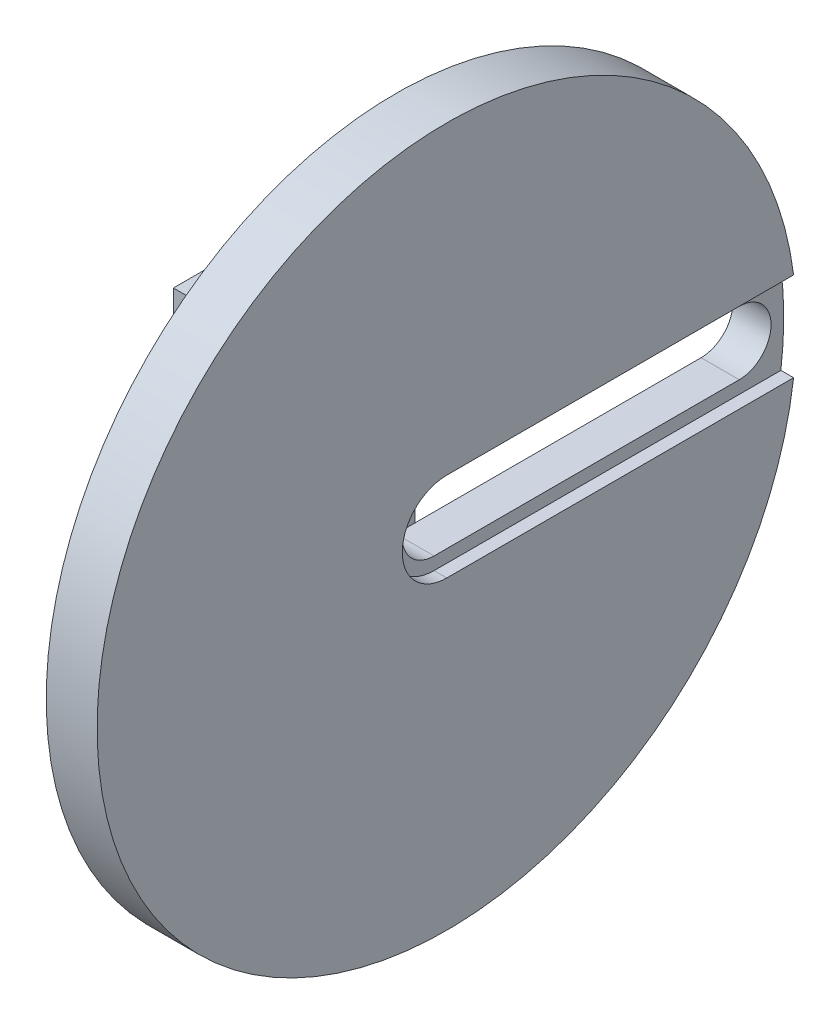
ISO-10303-21;
HEADER;
FILE_DESCRIPTION(('STEP AP214'),'2;1');
FILE_NAME('part.step','',(''),(''),'','','');
FILE_SCHEMA(('AUTOMOTIVE_DESIGN { 1 0 10303 214 1 1 1 1 }'));
ENDSEC;
DATA;
#1=APPLICATION_CONTEXT('core data for automotive mechanical design processes');
#2=APPLICATION_PROTOCOL_DEFINITION('international standard','automotive_design',2000,#1);
#3=PRODUCT_CONTEXT('',#1,'mechanical');
#4=PRODUCT('Part','Part','',(#3));
#5=PRODUCT_RELATED_PRODUCT_CATEGORY('part','',(#4));
#6=PRODUCT_DEFINITION_FORMATION('','',#4);
#7=PRODUCT_DEFINITION_CONTEXT('part definition',#1,'design');
#8=PRODUCT_DEFINITION('design','',#6,#7);
#9=PRODUCT_DEFINITION_SHAPE('','',#8);
#10=(LENGTH_UNIT() NAMED_UNIT(*) SI_UNIT(.MILLI.,.METRE.));
#11=(NAMED_UNIT(*) PLANE_ANGLE_UNIT() SI_UNIT($,.RADIAN.));
#12=(NAMED_UNIT(*) SI_UNIT($,.STERADIAN.) SOLID_ANGLE_UNIT());
#13=UNCERTAINTY_MEASURE_WITH_UNIT(LENGTH_MEASURE(1.E-05),#10,'distance_accuracy_value','');
#14=(GEOMETRIC_REPRESENTATION_CONTEXT(3) GLOBAL_UNCERTAINTY_ASSIGNED_CONTEXT((#13)) GLOBAL_UNIT_ASSIGNED_CONTEXT((#10,
#11,#12)) REPRESENTATION_CONTEXT('',''));
#15=CARTESIAN_POINT('',(0.,0.,0.));
#16=DIRECTION('',(0.,0.,1.));
#17=DIRECTION('',(1.,0.,0.));
#18=AXIS2_PLACEMENT_3D('',#15,#16,#17);
#19=CARTESIAN_POINT('',(-0.001000000000001,0.,0.));
#20=DIRECTION('',(1.,0.,0.));
#21=DIRECTION('',(0.,0.,-1.));
#22=AXIS2_PLACEMENT_3D('',#19,#20,#21);
#23=CYLINDRICAL_SURFACE('',#22,5.);
#24=CARTESIAN_POINT('',(36.,0.,0.));
#25=DIRECTION('',(1.,0.,0.));
#26=DIRECTION('',(0.,0.,-1.));
#27=AXIS2_PLACEMENT_3D('',#24,#25,#26);
#28=CIRCLE('',#27,5.);
#29=CARTESIAN_POINT('',(36.,-5.,0.));
#30=VERTEX_POINT('',#29);
#31=CARTESIAN_POINT('',(36.,5.,0.));
#32=VERTEX_POINT('',#31);
#33=EDGE_CURVE('E186',#30,#32,#28,.F.);
#34=ORIENTED_EDGE('',*,*,#33,.F.);
#35=DIRECTION('',(1.,0.,0.));
#36=VECTOR('',#35,1.);
#37=CARTESIAN_POINT('',(-0.001000000000001,-5.,0.));
#38=LINE('',#37,#36);
#39=CARTESIAN_POINT('',(30.,-5.,0.));
#40=VERTEX_POINT('',#39);
#41=EDGE_CURVE('E196',#40,#30,#38,.T.);
#42=ORIENTED_EDGE('',*,*,#41,.F.);
#43=CARTESIAN_POINT('',(30.,0.,0.));
#44=DIRECTION('',(1.,0.,0.));
#45=DIRECTION('',(0.,0.,-1.));
#46=AXIS2_PLACEMENT_3D('',#43,#44,#45);
#47=CIRCLE('',#46,5.);
#48=CARTESIAN_POINT('',(30.,5.,0.));
#49=VERTEX_POINT('',#48);
#50=EDGE_CURVE('E193',#40,#49,#47,.F.);
#51=ORIENTED_EDGE('',*,*,#50,.T.);
#52=DIRECTION('',(1.,0.,0.));
#53=VECTOR('',#52,1.);
#54=CARTESIAN_POINT('',(-0.001000000000001,5.,0.));
#55=LINE('',#54,#53);
#56=EDGE_CURVE('E197',#49,#32,#55,.T.);
#57=ORIENTED_EDGE('',*,*,#56,.T.);
#58=EDGE_LOOP('',(#34,#42,#51,#57));
#59=FACE_BOUND('',#58,.T.);
#60=ADVANCED_FACE('F32',(#59),#23,.F.);
#61=CARTESIAN_POINT('',(-0.001000000000001,5.,0.));
#62=DIRECTION('',(0.,-1.,0.));
#63=DIRECTION('',(0.,0.,-1.));
#64=AXIS2_PLACEMENT_3D('',#61,#62,#63);
#65=PLANE('',#64);
#66=DIRECTION('',(1.,0.,0.));
#67=VECTOR('',#66,1.);
#68=CARTESIAN_POINT('',(-0.001000000000001,5.,-48.));
#69=LINE('',#68,#67);
#70=CARTESIAN_POINT('',(30.,5.,-48.));
#71=VERTEX_POINT('',#70);
#72=CARTESIAN_POINT('',(36.,5.,-48.));
#73=VERTEX_POINT('',#72);
#74=EDGE_CURVE('E201',#71,#73,#69,.T.);
#75=ORIENTED_EDGE('',*,*,#74,.T.);
#76=DIRECTION('',(0.,0.,1.));
#77=VECTOR('',#76,1.);
#78=CARTESIAN_POINT('',(36.,5.,0.));
#79=LINE('',#78,#77);
#80=EDGE_CURVE('E183',#73,#32,#79,.T.);
#81=ORIENTED_EDGE('',*,*,#80,.T.);
#82=ORIENTED_EDGE('',*,*,#56,.F.);
#83=DIRECTION('',(0.,0.,1.));
#84=VECTOR('',#83,1.);
#85=CARTESIAN_POINT('',(30.,5.,0.));
#86=LINE('',#85,#84);
#87=EDGE_CURVE('E190',#71,#49,#86,.T.);
#88=ORIENTED_EDGE('',*,*,#87,.F.);
#89=EDGE_LOOP('',(#75,#81,#82,#88));
#90=FACE_BOUND('',#89,.T.);
#91=ADVANCED_FACE('F337',(#90),#65,.T.);
#92=CARTESIAN_POINT('',(-0.001000000000001,0.,-48.));
#93=DIRECTION('',(1.,0.,0.));
#94=DIRECTION('',(0.,0.,-1.));
#95=AXIS2_PLACEMENT_3D('',#92,#93,#94);
#96=CYLINDRICAL_SURFACE('',#95,5.);
#97=CARTESIAN_POINT('',(36.,0.,-48.));
#98=DIRECTION('',(1.,0.,0.));
#99=DIRECTION('',(0.,0.,-1.));
#100=AXIS2_PLACEMENT_3D('',#97,#98,#99);
#101=CIRCLE('',#100,5.);
#102=CARTESIAN_POINT('',(36.,-5.,-48.));
#103=VERTEX_POINT('',#102);
#104=EDGE_CURVE('E54',#73,#103,#101,.F.);
#105=ORIENTED_EDGE('',*,*,#104,.F.);
#106=ORIENTED_EDGE('',*,*,#74,.F.);
#107=CARTESIAN_POINT('',(30.,0.,-48.));
#108=DIRECTION('',(1.,0.,0.));
#109=DIRECTION('',(0.,0.,-1.));
#110=AXIS2_PLACEMENT_3D('',#107,#108,#109);
#111=CIRCLE('',#110,5.);
#112=CARTESIAN_POINT('',(30.,-5.,-48.));
#113=VERTEX_POINT('',#112);
#114=EDGE_CURVE('E188',#71,#113,#111,.F.);
#115=ORIENTED_EDGE('',*,*,#114,.T.);
#116=DIRECTION('',(1.,0.,0.));
#117=VECTOR('',#116,1.);
#118=CARTESIAN_POINT('',(-0.001000000000001,-5.,-48.));
#119=LINE('',#118,#117);
#120=EDGE_CURVE('E204',#113,#103,#119,.T.);
#121=ORIENTED_EDGE('',*,*,#120,.T.);
#122=EDGE_LOOP('',(#105,#106,#115,#121));
#123=FACE_BOUND('',#122,.T.);
#124=ADVANCED_FACE('F343',(#123),#96,.F.);
#125=CARTESIAN_POINT('',(-0.001000000000001,-5.,0.));
#126=DIRECTION('',(0.,-1.,0.));
#127=DIRECTION('',(0.,0.,-1.));
#128=AXIS2_PLACEMENT_3D('',#125,#126,#127);
#129=PLANE('',#128);
#130=DIRECTION('',(0.,0.,1.));
#131=VECTOR('',#130,1.);
#132=CARTESIAN_POINT('',(36.,-5.,0.));
#133=LINE('',#132,#131);
#134=EDGE_CURVE('E11',#103,#30,#133,.T.);
#135=ORIENTED_EDGE('',*,*,#134,.F.);
#136=ORIENTED_EDGE('',*,*,#120,.F.);
#137=DIRECTION('',(0.,0.,1.));
#138=VECTOR('',#137,1.);
#139=CARTESIAN_POINT('',(30.,-5.,0.));
#140=LINE('',#139,#138);
#141=EDGE_CURVE('E200',#113,#40,#140,.T.);
#142=ORIENTED_EDGE('',*,*,#141,.T.);
#143=ORIENTED_EDGE('',*,*,#41,.T.);
#144=EDGE_LOOP('',(#135,#136,#142,#143));
#145=FACE_BOUND('',#144,.T.);
#146=ADVANCED_FACE('F348',(#145),#129,.F.);
#147=CARTESIAN_POINT('',(18.,0.,0.));
#148=DIRECTION('',(-1.,0.,0.));
#149=DIRECTION('',(0.,0.,1.));
#150=AXIS2_PLACEMENT_3D('',#147,#148,#149);
#151=PLANE('',#150);
#152=CARTESIAN_POINT('',(18.,0.,0.));
#153=DIRECTION('',(-1.,0.,0.));
#154=DIRECTION('',(0.,0.,1.));
#155=AXIS2_PLACEMENT_3D('',#152,#153,#154);
#156=CIRCLE('',#155,9.);
#157=CARTESIAN_POINT('',(18.,0.,9.));
#158=VERTEX_POINT('',#157);
#159=EDGE_CURVE('E175',#158,#158,#156,.F.);
#160=ORIENTED_EDGE('',*,*,#159,.F.);
#161=EDGE_LOOP('',(#160));
#162=FACE_BOUND('',#161,.T.);
#163=DIRECTION('',(0.,0.,1.));
#164=VECTOR('',#163,1.);
#165=CARTESIAN_POINT('',(18.,-18.,15.));
#166=LINE('',#165,#164);
#167=CARTESIAN_POINT('',(18.,-18.,-15.));
#168=VERTEX_POINT('',#167);
#169=CARTESIAN_POINT('',(18.,-18.,15.));
#170=VERTEX_POINT('',#169);
#171=EDGE_CURVE('E215',#168,#170,#166,.T.);
#172=ORIENTED_EDGE('',*,*,#171,.F.);
#173=DIRECTION('',(0.,1.,0.));
#174=VECTOR('',#173,1.);
#175=CARTESIAN_POINT('',(18.,-26.,-15.));
#176=LINE('',#175,#174);
#177=CARTESIAN_POINT('',(18.,18.,-15.));
#178=VERTEX_POINT('',#177);
#179=EDGE_CURVE('E271',#168,#178,#176,.T.);
#180=ORIENTED_EDGE('',*,*,#179,.T.);
#181=DIRECTION('',(0.,0.,-1.));
#182=VECTOR('',#181,1.);
#183=CARTESIAN_POINT('',(18.,18.,15.));
#184=LINE('',#183,#182);
#185=CARTESIAN_POINT('',(18.,18.,15.));
#186=VERTEX_POINT('',#185);
#187=EDGE_CURVE('E238',#186,#178,#184,.T.);
#188=ORIENTED_EDGE('',*,*,#187,.F.);
#189=DIRECTION('',(0.,-1.,0.));
#190=VECTOR('',#189,1.);
#191=CARTESIAN_POINT('',(18.,-26.,15.));
#192=LINE('',#191,#190);
#193=EDGE_CURVE('E260',#186,#170,#192,.T.);
#194=ORIENTED_EDGE('',*,*,#193,.T.);
#195=EDGE_LOOP('',(#172,#180,#188,#194));
#196=FACE_BOUND('',#195,.T.);
#197=ADVANCED_FACE('F317',(#162,#196),#151,.F.);
#198=CARTESIAN_POINT('',(10.,0.,0.));
#199=DIRECTION('',(-1.,0.,0.));
#200=DIRECTION('',(0.,0.,1.));
#201=AXIS2_PLACEMENT_3D('',#198,#199,#200);
#202=PLANE('',#201);
#203=CARTESIAN_POINT('',(10.,0.,0.));
#204=DIRECTION('',(-1.,0.,0.));
#205=DIRECTION('',(0.,0.,1.));
#206=AXIS2_PLACEMENT_3D('',#203,#204,#205);
#207=CIRCLE('',#206,9.);
#208=CARTESIAN_POINT('',(10.,0.,9.));
#209=VERTEX_POINT('',#208);
#210=EDGE_CURVE('E169',#209,#209,#207,.F.);
#211=ORIENTED_EDGE('',*,*,#210,.T.);
#212=EDGE_LOOP('',(#211));
#213=FACE_BOUND('',#212,.T.);
#214=DIRECTION('',(0.,1.,0.));
#215=VECTOR('',#214,1.);
#216=CARTESIAN_POINT('',(10.,-26.,-15.));
#217=LINE('',#216,#215);
#218=CARTESIAN_POINT('',(10.,-26.,-15.));
#219=VERTEX_POINT('',#218);
#220=CARTESIAN_POINT('',(10.,26.,-15.));
#221=VERTEX_POINT('',#220);
#222=EDGE_CURVE('E269',#219,#221,#217,.T.);
#223=ORIENTED_EDGE('',*,*,#222,.F.);
#224=DIRECTION('',(0.,0.,-1.));
#225=VECTOR('',#224,1.);
#226=CARTESIAN_POINT('',(10.,-26.,15.));
#227=LINE('',#226,#225);
#228=CARTESIAN_POINT('',(10.,-26.,15.));
#229=VERTEX_POINT('',#228);
#230=EDGE_CURVE('E272',#229,#219,#227,.T.);
#231=ORIENTED_EDGE('',*,*,#230,.F.);
#232=DIRECTION('',(0.,-1.,0.));
#233=VECTOR('',#232,1.);
#234=CARTESIAN_POINT('',(10.,-26.,15.));
#235=LINE('',#234,#233);
#236=CARTESIAN_POINT('',(10.,26.,15.));
#237=VERTEX_POINT('',#236);
#238=EDGE_CURVE('E276',#237,#229,#235,.T.);
#239=ORIENTED_EDGE('',*,*,#238,.F.);
#240=DIRECTION('',(0.,0.,1.));
#241=VECTOR('',#240,1.);
#242=CARTESIAN_POINT('',(10.,26.,15.));
#243=LINE('',#242,#241);
#244=EDGE_CURVE('E282',#221,#237,#243,.T.);
#245=ORIENTED_EDGE('',*,*,#244,.F.);
#246=EDGE_LOOP('',(#223,#231,#239,#245));
#247=FACE_BOUND('',#246,.T.);
#248=ADVANCED_FACE('F302',(#213,#247),#202,.T.);
#249=CARTESIAN_POINT('',(18.,-26.,-15.));
#250=DIRECTION('',(0.,0.,1.));
#251=DIRECTION('',(1.,0.,0.));
#252=AXIS2_PLACEMENT_3D('',#249,#250,#251);
#253=PLANE('',#252);
#254=ORIENTED_EDGE('',*,*,#222,.T.);
#255=DIRECTION('',(-1.,0.,0.));
#256=VECTOR('',#255,1.);
#257=CARTESIAN_POINT('',(18.,26.,-15.));
#258=LINE('',#257,#256);
#259=CARTESIAN_POINT('',(30.,26.,-15.));
#260=VERTEX_POINT('',#259);
#261=EDGE_CURVE('E40',#260,#221,#258,.T.);
#262=ORIENTED_EDGE('',*,*,#261,.F.);
#263=DIRECTION('',(0.,1.,0.));
#264=VECTOR('',#263,1.);
#265=CARTESIAN_POINT('',(30.,26.,-15.));
#266=LINE('',#265,#264);
#267=CARTESIAN_POINT('',(30.,18.,-15.));
#268=VERTEX_POINT('',#267);
#269=EDGE_CURVE('E245',#268,#260,#266,.T.);
#270=ORIENTED_EDGE('',*,*,#269,.F.);
#271=DIRECTION('',(-1.,0.,0.));
#272=VECTOR('',#271,1.);
#273=CARTESIAN_POINT('',(30.,18.,-15.));
#274=LINE('',#273,#272);
#275=EDGE_CURVE('E251',#268,#178,#274,.T.);
#276=ORIENTED_EDGE('',*,*,#275,.T.);
#277=ORIENTED_EDGE('',*,*,#179,.F.);
#278=DIRECTION('',(-1.,0.,0.));
#279=VECTOR('',#278,1.);
#280=CARTESIAN_POINT('',(30.,-18.,-15.));
#281=LINE('',#280,#279);
#282=CARTESIAN_POINT('',(30.,-18.,-15.));
#283=VERTEX_POINT('',#282);
#284=EDGE_CURVE('E235',#283,#168,#281,.T.);
#285=ORIENTED_EDGE('',*,*,#284,.F.);
#286=DIRECTION('',(0.,1.,0.));
#287=VECTOR('',#286,1.);
#288=CARTESIAN_POINT('',(30.,-26.,-15.));
#289=LINE('',#288,#287);
#290=CARTESIAN_POINT('',(30.,-26.,-15.));
#291=VERTEX_POINT('',#290);
#292=EDGE_CURVE('E224',#291,#283,#289,.T.);
#293=ORIENTED_EDGE('',*,*,#292,.F.);
#294=DIRECTION('',(-1.,0.,0.));
#295=VECTOR('',#294,1.);
#296=CARTESIAN_POINT('',(18.,-26.,-15.));
#297=LINE('',#296,#295);
#298=EDGE_CURVE('E275',#291,#219,#297,.T.);
#299=ORIENTED_EDGE('',*,*,#298,.T.);
#300=EDGE_LOOP('',(#254,#262,#270,#276,#277,#285,#293,#299));
#301=FACE_BOUND('',#300,.T.);
#302=ADVANCED_FACE('F34',(#301),#253,.F.);
#303=CARTESIAN_POINT('',(18.,26.,15.));
#304=DIRECTION('',(0.,-1.,0.));
#305=DIRECTION('',(0.,0.,-1.));
#306=AXIS2_PLACEMENT_3D('',#303,#304,#305);
#307=PLANE('',#306);
#308=ORIENTED_EDGE('',*,*,#244,.T.);
#309=DIRECTION('',(-1.,0.,0.));
#310=VECTOR('',#309,1.);
#311=CARTESIAN_POINT('',(18.,26.,15.));
#312=LINE('',#311,#310);
#313=CARTESIAN_POINT('',(30.,26.,15.));
#314=VERTEX_POINT('',#313);
#315=EDGE_CURVE('E289',#314,#237,#312,.T.);
#316=ORIENTED_EDGE('',*,*,#315,.F.);
#317=DIRECTION('',(0.,0.,1.));
#318=VECTOR('',#317,1.);
#319=CARTESIAN_POINT('',(30.,26.,15.));
#320=LINE('',#319,#318);
#321=EDGE_CURVE('E248',#260,#314,#320,.T.);
#322=ORIENTED_EDGE('',*,*,#321,.F.);
#323=ORIENTED_EDGE('',*,*,#261,.T.);
#324=EDGE_LOOP('',(#308,#316,#322,#323));
#325=FACE_BOUND('',#324,.T.);
#326=ADVANCED_FACE('F295',(#325),#307,.F.);
#327=CARTESIAN_POINT('',(18.,-26.,15.));
#328=DIRECTION('',(0.,0.,-1.));
#329=DIRECTION('',(-1.,0.,0.));
#330=AXIS2_PLACEMENT_3D('',#327,#328,#329);
#331=PLANE('',#330);
#332=ORIENTED_EDGE('',*,*,#238,.T.);
#333=DIRECTION('',(-1.,0.,0.));
#334=VECTOR('',#333,1.);
#335=CARTESIAN_POINT('',(18.,-26.,15.));
#336=LINE('',#335,#334);
#337=CARTESIAN_POINT('',(30.,-26.,15.));
#338=VERTEX_POINT('',#337);
#339=EDGE_CURVE('E287',#338,#229,#336,.T.);
#340=ORIENTED_EDGE('',*,*,#339,.F.);
#341=DIRECTION('',(0.,-1.,0.));
#342=VECTOR('',#341,1.);
#343=CARTESIAN_POINT('',(30.,-26.,15.));
#344=LINE('',#343,#342);
#345=CARTESIAN_POINT('',(30.,-18.,15.));
#346=VERTEX_POINT('',#345);
#347=EDGE_CURVE('E218',#346,#338,#344,.T.);
#348=ORIENTED_EDGE('',*,*,#347,.F.);
#349=DIRECTION('',(-1.,0.,0.));
#350=VECTOR('',#349,1.);
#351=CARTESIAN_POINT('',(30.,-18.,15.));
#352=LINE('',#351,#350);
#353=EDGE_CURVE('E230',#346,#170,#352,.T.);
#354=ORIENTED_EDGE('',*,*,#353,.T.);
#355=ORIENTED_EDGE('',*,*,#193,.F.);
#356=DIRECTION('',(-1.,0.,0.));
#357=VECTOR('',#356,1.);
#358=CARTESIAN_POINT('',(30.,18.,15.));
#359=LINE('',#358,#357);
#360=CARTESIAN_POINT('',(30.,18.,15.));
#361=VERTEX_POINT('',#360);
#362=EDGE_CURVE('E264',#361,#186,#359,.T.);
#363=ORIENTED_EDGE('',*,*,#362,.F.);
#364=DIRECTION('',(0.,-1.,0.));
#365=VECTOR('',#364,1.);
#366=CARTESIAN_POINT('',(30.,26.,15.));
#367=LINE('',#366,#365);
#368=EDGE_CURVE('E239',#314,#361,#367,.T.);
#369=ORIENTED_EDGE('',*,*,#368,.F.);
#370=ORIENTED_EDGE('',*,*,#315,.T.);
#371=EDGE_LOOP('',(#332,#340,#348,#354,#355,#363,#369,#370));
#372=FACE_BOUND('',#371,.T.);
#373=ADVANCED_FACE('F305',(#372),#331,.F.);
#374=CARTESIAN_POINT('',(18.,-26.,15.));
#375=DIRECTION('',(0.,1.,0.));
#376=DIRECTION('',(0.,0.,1.));
#377=AXIS2_PLACEMENT_3D('',#374,#375,#376);
#378=PLANE('',#377);
#379=ORIENTED_EDGE('',*,*,#230,.T.);
#380=ORIENTED_EDGE('',*,*,#298,.F.);
#381=DIRECTION('',(0.,0.,-1.));
#382=VECTOR('',#381,1.);
#383=CARTESIAN_POINT('',(30.,-26.,15.));
#384=LINE('',#383,#382);
#385=EDGE_CURVE('E221',#338,#291,#384,.T.);
#386=ORIENTED_EDGE('',*,*,#385,.F.);
#387=ORIENTED_EDGE('',*,*,#339,.T.);
#388=EDGE_LOOP('',(#379,#380,#386,#387));
#389=FACE_BOUND('',#388,.T.);
#390=ADVANCED_FACE('F308',(#389),#378,.F.);
#391=CARTESIAN_POINT('',(30.,18.,15.));
#392=DIRECTION('',(0.,1.,0.));
#393=DIRECTION('',(0.,0.,1.));
#394=AXIS2_PLACEMENT_3D('',#391,#392,#393);
#395=PLANE('',#394);
#396=ORIENTED_EDGE('',*,*,#187,.T.);
#397=ORIENTED_EDGE('',*,*,#275,.F.);
#398=DIRECTION('',(0.,0.,-1.));
#399=VECTOR('',#398,1.);
#400=CARTESIAN_POINT('',(30.,18.,15.));
#401=LINE('',#400,#399);
#402=EDGE_CURVE('E242',#361,#268,#401,.T.);
#403=ORIENTED_EDGE('',*,*,#402,.F.);
#404=ORIENTED_EDGE('',*,*,#362,.T.);
#405=EDGE_LOOP('',(#396,#397,#403,#404));
#406=FACE_BOUND('',#405,.T.);
#407=ADVANCED_FACE('F320',(#406),#395,.F.);
#408=CARTESIAN_POINT('',(30.,-18.,15.));
#409=DIRECTION('',(0.,-1.,0.));
#410=DIRECTION('',(0.,0.,-1.));
#411=AXIS2_PLACEMENT_3D('',#408,#409,#410);
#412=PLANE('',#411);
#413=ORIENTED_EDGE('',*,*,#171,.T.);
#414=ORIENTED_EDGE('',*,*,#353,.F.);
#415=DIRECTION('',(0.,0.,1.));
#416=VECTOR('',#415,1.);
#417=CARTESIAN_POINT('',(30.,-18.,15.));
#418=LINE('',#417,#416);
#419=EDGE_CURVE('E227',#283,#346,#418,.T.);
#420=ORIENTED_EDGE('',*,*,#419,.F.);
#421=ORIENTED_EDGE('',*,*,#284,.T.);
#422=EDGE_LOOP('',(#413,#414,#420,#421));
#423=FACE_BOUND('',#422,.T.);
#424=ADVANCED_FACE('F316',(#423),#412,.F.);
#425=CARTESIAN_POINT('',(30.,0.,0.));
#426=DIRECTION('',(1.,0.,0.));
#427=DIRECTION('',(0.,0.,-1.));
#428=AXIS2_PLACEMENT_3D('',#425,#426,#427);
#429=PLANE('',#428);
#430=ORIENTED_EDGE('',*,*,#87,.T.);
#431=ORIENTED_EDGE('',*,*,#50,.F.);
#432=ORIENTED_EDGE('',*,*,#141,.F.);
#433=ORIENTED_EDGE('',*,*,#114,.F.);
#434=EDGE_LOOP('',(#430,#431,#432,#433));
#435=FACE_BOUND('',#434,.T.);
#436=ORIENTED_EDGE('',*,*,#347,.T.);
#437=ORIENTED_EDGE('',*,*,#385,.T.);
#438=ORIENTED_EDGE('',*,*,#292,.T.);
#439=ORIENTED_EDGE('',*,*,#419,.T.);
#440=EDGE_LOOP('',(#436,#437,#438,#439));
#441=FACE_BOUND('',#440,.T.);
#442=CARTESIAN_POINT('',(30.,0.,0.));
#443=DIRECTION('',(1.,0.,0.));
#444=DIRECTION('',(0.,0.,-1.));
#445=AXIS2_PLACEMENT_3D('',#442,#443,#444);
#446=CIRCLE('',#445,55.);
#447=CARTESIAN_POINT('',(30.,0.,-55.));
#448=VERTEX_POINT('',#447);
#449=EDGE_CURVE('E211',#448,#448,#446,.T.);
#450=ORIENTED_EDGE('',*,*,#449,.F.);
#451=EDGE_LOOP('',(#450));
#452=FACE_BOUND('',#451,.T.);
#453=ORIENTED_EDGE('',*,*,#402,.T.);
#454=ORIENTED_EDGE('',*,*,#269,.T.);
#455=ORIENTED_EDGE('',*,*,#321,.T.);
#456=ORIENTED_EDGE('',*,*,#368,.T.);
#457=EDGE_LOOP('',(#453,#454,#455,#456));
#458=FACE_BOUND('',#457,.T.);
#459=ADVANCED_FACE('F310',(#435,#441,#452,#458),#429,.F.);
#460=CARTESIAN_POINT('',(38.,0.,0.));
#461=DIRECTION('',(-1.,0.,0.));
#462=DIRECTION('',(0.,0.,1.));
#463=AXIS2_PLACEMENT_3D('',#460,#461,#462);
#464=CYLINDRICAL_SURFACE('',#463,55.);
#465=CARTESIAN_POINT('',(38.,0.,0.));
#466=DIRECTION('',(1.,0.,0.));
#467=DIRECTION('',(0.,0.,-1.));
#468=AXIS2_PLACEMENT_3D('',#465,#466,#467);
#469=CIRCLE('',#468,55.);
#470=CARTESIAN_POINT('',(38.,6.99999999999998,-54.5527267879434));
#471=VERTEX_POINT('',#470);
#472=CARTESIAN_POINT('',(38.,-7.,-54.5527267879434));
#473=VERTEX_POINT('',#472);
#474=EDGE_CURVE('E212',#471,#473,#469,.T.);
#475=ORIENTED_EDGE('',*,*,#474,.F.);
#476=DIRECTION('',(1.,0.,0.));
#477=VECTOR('',#476,1.);
#478=CARTESIAN_POINT('',(36.,6.99999999999998,-54.5527267879434));
#479=LINE('',#478,#477);
#480=CARTESIAN_POINT('',(36.,6.99999999999998,-54.5527267879434));
#481=VERTEX_POINT('',#480);
#482=EDGE_CURVE('E179',#481,#471,#479,.T.);
#483=ORIENTED_EDGE('',*,*,#482,.F.);
#484=CARTESIAN_POINT('',(36.,0.,0.));
#485=DIRECTION('',(1.,0.,0.));
#486=DIRECTION('',(0.,0.,-1.));
#487=AXIS2_PLACEMENT_3D('',#484,#485,#486);
#488=CIRCLE('',#487,55.);
#489=CARTESIAN_POINT('',(36.,-7.,-54.5527267879434));
#490=VERTEX_POINT('',#489);
#491=EDGE_CURVE('E159',#490,#481,#488,.T.);
#492=ORIENTED_EDGE('',*,*,#491,.F.);
#493=DIRECTION('',(1.,0.,0.));
#494=VECTOR('',#493,1.);
#495=CARTESIAN_POINT('',(36.,-7.,-54.5527267879434));
#496=LINE('',#495,#494);
#497=EDGE_CURVE('E150',#490,#473,#496,.T.);
#498=ORIENTED_EDGE('',*,*,#497,.T.);
#499=EDGE_LOOP('',(#475,#483,#492,#498));
#500=FACE_BOUND('',#499,.T.);
#501=ORIENTED_EDGE('',*,*,#449,.T.);
#502=EDGE_LOOP('',(#501));
#503=FACE_BOUND('',#502,.T.);
#504=ADVANCED_FACE('F324',(#500,#503),#464,.T.);
#505=CARTESIAN_POINT('',(38.,0.,0.));
#506=DIRECTION('',(1.,0.,0.));
#507=DIRECTION('',(0.,0.,-1.));
#508=AXIS2_PLACEMENT_3D('',#505,#506,#507);
#509=PLANE('',#508);
#510=DIRECTION('',(0.,0.,1.));
#511=VECTOR('',#510,1.);
#512=CARTESIAN_POINT('',(38.,7.,0.));
#513=LINE('',#512,#511);
#514=CARTESIAN_POINT('',(38.,7.,0.));
#515=VERTEX_POINT('',#514);
#516=EDGE_CURVE('E163',#471,#515,#513,.T.);
#517=ORIENTED_EDGE('',*,*,#516,.F.);
#518=ORIENTED_EDGE('',*,*,#474,.T.);
#519=DIRECTION('',(0.,0.,-1.));
#520=VECTOR('',#519,1.);
#521=CARTESIAN_POINT('',(38.,-7.,0.));
#522=LINE('',#521,#520);
#523=CARTESIAN_POINT('',(38.,-7.,0.));
#524=VERTEX_POINT('',#523);
#525=EDGE_CURVE('E166',#524,#473,#522,.T.);
#526=ORIENTED_EDGE('',*,*,#525,.F.);
#527=CARTESIAN_POINT('',(38.,0.,0.));
#528=DIRECTION('',(1.,0.,0.));
#529=DIRECTION('',(0.,0.,-1.));
#530=AXIS2_PLACEMENT_3D('',#527,#528,#529);
#531=CIRCLE('',#530,7.);
#532=EDGE_CURVE('E47',#515,#524,#531,.T.);
#533=ORIENTED_EDGE('',*,*,#532,.F.);
#534=EDGE_LOOP('',(#517,#518,#526,#533));
#535=FACE_BOUND('',#534,.T.);
#536=ADVANCED_FACE('F331',(#535),#509,.T.);
#537=CARTESIAN_POINT('',(36.,0.,0.));
#538=DIRECTION('',(1.,0.,0.));
#539=DIRECTION('',(0.,0.,-1.));
#540=AXIS2_PLACEMENT_3D('',#537,#538,#539);
#541=PLANE('',#540);
#542=CARTESIAN_POINT('',(36.,0.,0.));
#543=DIRECTION('',(1.,0.,0.));
#544=DIRECTION('',(0.,0.,-1.));
#545=AXIS2_PLACEMENT_3D('',#542,#543,#544);
#546=CIRCLE('',#545,7.);
#547=CARTESIAN_POINT('',(36.,7.,0.));
#548=VERTEX_POINT('',#547);
#549=CARTESIAN_POINT('',(36.,-7.,0.));
#550=VERTEX_POINT('',#549);
#551=EDGE_CURVE('E146',#548,#550,#546,.T.);
#552=ORIENTED_EDGE('',*,*,#551,.T.);
#553=DIRECTION('',(0.,0.,-1.));
#554=VECTOR('',#553,1.);
#555=CARTESIAN_POINT('',(36.,-7.,0.));
#556=LINE('',#555,#554);
#557=EDGE_CURVE('E154',#550,#490,#556,.T.);
#558=ORIENTED_EDGE('',*,*,#557,.T.);
#559=ORIENTED_EDGE('',*,*,#491,.T.);
#560=DIRECTION('',(0.,0.,1.));
#561=VECTOR('',#560,1.);
#562=CARTESIAN_POINT('',(36.,7.,0.));
#563=LINE('',#562,#561);
#564=EDGE_CURVE('E151',#481,#548,#563,.T.);
#565=ORIENTED_EDGE('',*,*,#564,.T.);
#566=EDGE_LOOP('',(#552,#558,#559,#565));
#567=FACE_BOUND('',#566,.T.);
#568=ORIENTED_EDGE('',*,*,#33,.T.);
#569=ORIENTED_EDGE('',*,*,#80,.F.);
#570=ORIENTED_EDGE('',*,*,#104,.T.);
#571=ORIENTED_EDGE('',*,*,#134,.T.);
#572=EDGE_LOOP('',(#568,#569,#570,#571));
#573=FACE_BOUND('',#572,.T.);
#574=ADVANCED_FACE('F161',(#567,#573),#541,.T.);
#575=CARTESIAN_POINT('',(36.,0.,0.));
#576=DIRECTION('',(1.,0.,0.));
#577=DIRECTION('',(0.,0.,-1.));
#578=AXIS2_PLACEMENT_3D('',#575,#576,#577);
#579=CYLINDRICAL_SURFACE('',#578,7.);
#580=ORIENTED_EDGE('',*,*,#532,.T.);
#581=DIRECTION('',(1.,0.,0.));
#582=VECTOR('',#581,1.);
#583=CARTESIAN_POINT('',(36.,-7.,0.));
#584=LINE('',#583,#582);
#585=EDGE_CURVE('E142',#550,#524,#584,.T.);
#586=ORIENTED_EDGE('',*,*,#585,.F.);
#587=ORIENTED_EDGE('',*,*,#551,.F.);
#588=DIRECTION('',(1.,0.,0.));
#589=VECTOR('',#588,1.);
#590=CARTESIAN_POINT('',(36.,7.,0.));
#591=LINE('',#590,#589);
#592=EDGE_CURVE('E177',#548,#515,#591,.T.);
#593=ORIENTED_EDGE('',*,*,#592,.T.);
#594=EDGE_LOOP('',(#580,#586,#587,#593));
#595=FACE_BOUND('',#594,.T.);
#596=ADVANCED_FACE('F144',(#595),#579,.F.);
#597=CARTESIAN_POINT('',(36.,7.,0.));
#598=DIRECTION('',(0.,1.,0.));
#599=DIRECTION('',(0.,0.,1.));
#600=AXIS2_PLACEMENT_3D('',#597,#598,#599);
#601=PLANE('',#600);
#602=ORIENTED_EDGE('',*,*,#516,.T.);
#603=ORIENTED_EDGE('',*,*,#592,.F.);
#604=ORIENTED_EDGE('',*,*,#564,.F.);
#605=ORIENTED_EDGE('',*,*,#482,.T.);
#606=EDGE_LOOP('',(#602,#603,#604,#605));
#607=FACE_BOUND('',#606,.T.);
#608=ADVANCED_FACE('F361',(#607),#601,.F.);
#609=CARTESIAN_POINT('',(36.,-7.,0.));
#610=DIRECTION('',(0.,-1.,0.));
#611=DIRECTION('',(0.,0.,-1.));
#612=AXIS2_PLACEMENT_3D('',#609,#610,#611);
#613=PLANE('',#612);
#614=ORIENTED_EDGE('',*,*,#525,.T.);
#615=ORIENTED_EDGE('',*,*,#497,.F.);
#616=ORIENTED_EDGE('',*,*,#557,.F.);
#617=ORIENTED_EDGE('',*,*,#585,.T.);
#618=EDGE_LOOP('',(#614,#615,#616,#617));
#619=FACE_BOUND('',#618,.T.);
#620=ADVANCED_FACE('F155',(#619),#613,.F.);
#621=CARTESIAN_POINT('',(38.001,0.,0.));
#622=DIRECTION('',(-1.,0.,0.));
#623=DIRECTION('',(0.,0.,1.));
#624=AXIS2_PLACEMENT_3D('',#621,#622,#623);
#625=CYLINDRICAL_SURFACE('',#624,9.);
#626=ORIENTED_EDGE('',*,*,#210,.F.);
#627=EDGE_LOOP('',(#626));
#628=FACE_BOUND('',#627,.T.);
#629=ORIENTED_EDGE('',*,*,#159,.T.);
#630=EDGE_LOOP('',(#629));
#631=FACE_BOUND('',#630,.T.);
#632=ADVANCED_FACE('F368',(#628,#631),#625,.F.);
#633=CLOSED_SHELL('',(#60,#91,#124,#146,#197,#248,#302,#326,#373,#390,#407,#424,#459,#504,#536,
#574,#596,#608,#620,#632));
#634=MANIFOLD_SOLID_BREP('B2',#633);
#635=ADVANCED_BREP_SHAPE_REPRESENTATION('',(#18,#634),#14);
#636=SHAPE_DEFINITION_REPRESENTATION(#9,#635);
ENDSEC;
END-ISO-10303-21;
